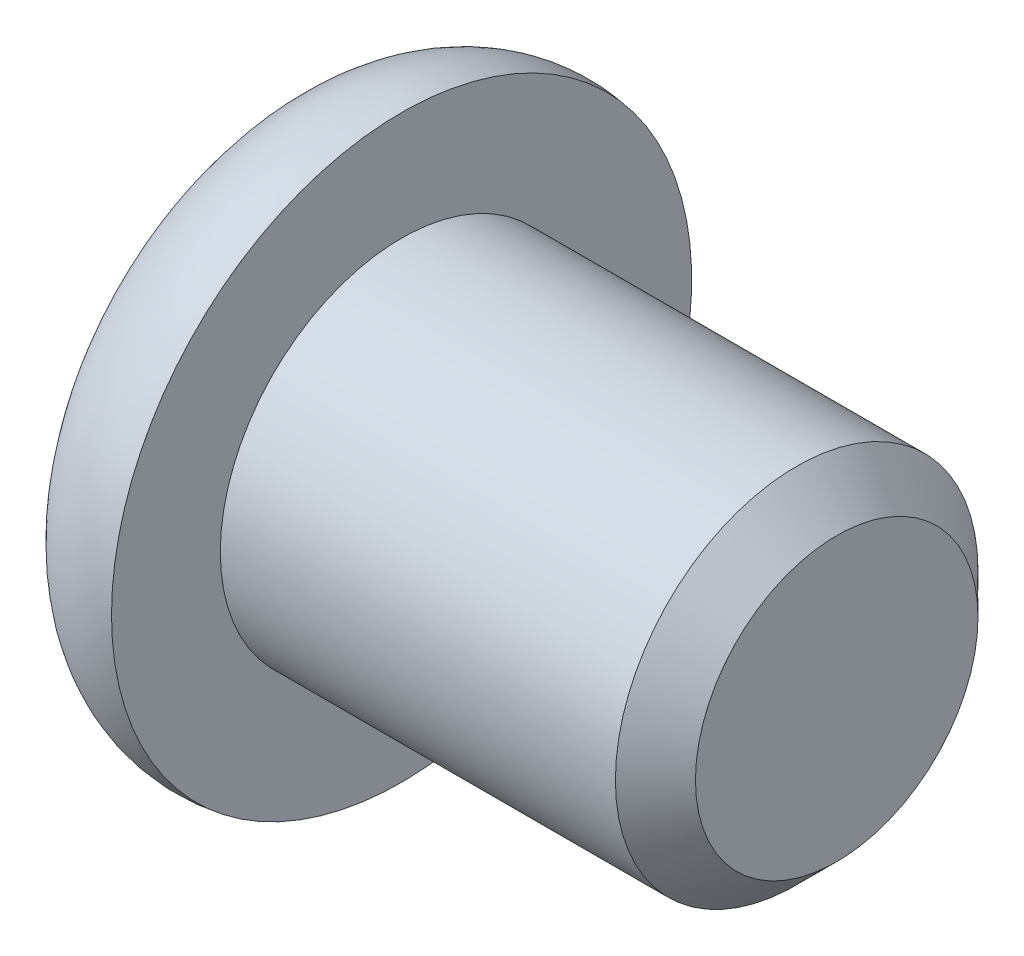
ISO-10303-21;
HEADER;
FILE_DESCRIPTION(('STEP AP214'),'2;1');
FILE_NAME('part.step','',(''),(''),'','','');
FILE_SCHEMA(('AUTOMOTIVE_DESIGN { 1 0 10303 214 1 1 1 1 }'));
ENDSEC;
DATA;
#1=APPLICATION_CONTEXT('core data for automotive mechanical design processes');
#2=APPLICATION_PROTOCOL_DEFINITION('international standard','automotive_design',2000,#1);
#3=PRODUCT_CONTEXT('',#1,'mechanical');
#4=PRODUCT('Part','Part','',(#3));
#5=PRODUCT_RELATED_PRODUCT_CATEGORY('part','',(#4));
#6=PRODUCT_DEFINITION_FORMATION('','',#4);
#7=PRODUCT_DEFINITION_CONTEXT('part definition',#1,'design');
#8=PRODUCT_DEFINITION('design','',#6,#7);
#9=PRODUCT_DEFINITION_SHAPE('','',#8);
#10=(LENGTH_UNIT() NAMED_UNIT(*) SI_UNIT(.MILLI.,.METRE.));
#11=(NAMED_UNIT(*) PLANE_ANGLE_UNIT() SI_UNIT($,.RADIAN.));
#12=(NAMED_UNIT(*) SI_UNIT($,.STERADIAN.) SOLID_ANGLE_UNIT());
#13=UNCERTAINTY_MEASURE_WITH_UNIT(LENGTH_MEASURE(1.E-05),#10,'distance_accuracy_value','');
#14=(GEOMETRIC_REPRESENTATION_CONTEXT(3) GLOBAL_UNCERTAINTY_ASSIGNED_CONTEXT((#13)) GLOBAL_UNIT_ASSIGNED_CONTEXT((#10,
#11,#12)) REPRESENTATION_CONTEXT('',''));
#15=CARTESIAN_POINT('',(0.,0.,0.));
#16=DIRECTION('',(0.,0.,1.));
#17=DIRECTION('',(1.,0.,0.));
#18=AXIS2_PLACEMENT_3D('',#15,#16,#17);
#19=CARTESIAN_POINT('',(0.4,-0.6,0.2));
#20=DIRECTION('',(-0.948683298050514,0.316227766016838,0.));
#21=DIRECTION('',(-0.316227766016838,-0.948683298050514,0.));
#22=AXIS2_PLACEMENT_3D('',#19,#20,#21);
#23=PLANE('',#22);
#24=DIRECTION('',(0.316227766016838,0.948683298050514,0.));
#25=VECTOR('',#24,1.);
#26=CARTESIAN_POINT('',(0.4,-0.6,0.2));
#27=LINE('',#26,#25);
#28=CARTESIAN_POINT('',(0.4,-0.6,0.2));
#29=VERTEX_POINT('',#28);
#30=CARTESIAN_POINT('',(0.533333333333333,-0.2,0.2));
#31=VERTEX_POINT('',#30);
#32=EDGE_CURVE('E212',#29,#31,#27,.T.);
#33=ORIENTED_EDGE('',*,*,#32,.T.);
#34=DIRECTION('',(0.,0.,-1.));
#35=VECTOR('',#34,1.);
#36=CARTESIAN_POINT('',(0.533333333333333,-0.2,0.2));
#37=LINE('',#36,#35);
#38=CARTESIAN_POINT('',(0.533333333333333,-0.2,-0.2));
#39=VERTEX_POINT('',#38);
#40=EDGE_CURVE('E163',#31,#39,#37,.T.);
#41=ORIENTED_EDGE('',*,*,#40,.T.);
#42=DIRECTION('',(0.316227766016838,0.948683298050514,0.));
#43=VECTOR('',#42,1.);
#44=CARTESIAN_POINT('',(0.4,-0.6,-0.2));
#45=LINE('',#44,#43);
#46=CARTESIAN_POINT('',(0.4,-0.6,-0.2));
#47=VERTEX_POINT('',#46);
#48=EDGE_CURVE('E198',#47,#39,#45,.T.);
#49=ORIENTED_EDGE('',*,*,#48,.F.);
#50=DIRECTION('',(0.,0.,-1.));
#51=VECTOR('',#50,1.);
#52=CARTESIAN_POINT('',(0.4,-0.6,0.2));
#53=LINE('',#52,#51);
#54=EDGE_CURVE('E231',#29,#47,#53,.T.);
#55=ORIENTED_EDGE('',*,*,#54,.F.);
#56=EDGE_LOOP('',(#33,#41,#49,#55));
#57=FACE_BOUND('',#56,.T.);
#58=ADVANCED_FACE('F37',(#57),#23,.T.);
#59=CARTESIAN_POINT('',(0.,0.,0.2));
#60=DIRECTION('',(0.,0.,1.));
#61=DIRECTION('',(1.,0.,0.));
#62=AXIS2_PLACEMENT_3D('',#59,#60,#61);
#63=PLANE('',#62);
#64=DIRECTION('',(-1.,0.,0.));
#65=VECTOR('',#64,1.);
#66=CARTESIAN_POINT('',(0.,-0.2,0.2));
#67=LINE('',#66,#65);
#68=CARTESIAN_POINT('',(-0.8,-0.2,0.2));
#69=VERTEX_POINT('',#68);
#70=EDGE_CURVE('E144',#31,#69,#67,.T.);
#71=ORIENTED_EDGE('',*,*,#70,.F.);
#72=ORIENTED_EDGE('',*,*,#32,.F.);
#73=DIRECTION('',(0.894427190999916,0.447213595499958,0.));
#74=VECTOR('',#73,1.);
#75=CARTESIAN_POINT('',(-0.8,-1.2,0.2));
#76=LINE('',#75,#74);
#77=CARTESIAN_POINT('',(-0.8,-1.2,0.2));
#78=VERTEX_POINT('',#77);
#79=EDGE_CURVE('E209',#78,#29,#76,.T.);
#80=ORIENTED_EDGE('',*,*,#79,.F.);
#81=DIRECTION('',(0.,-1.,0.));
#82=VECTOR('',#81,1.);
#83=CARTESIAN_POINT('',(-0.8,1.2,0.2));
#84=LINE('',#83,#82);
#85=EDGE_CURVE('E206',#69,#78,#84,.T.);
#86=ORIENTED_EDGE('',*,*,#85,.F.);
#87=EDGE_LOOP('',(#71,#72,#80,#86));
#88=FACE_BOUND('',#87,.T.);
#89=ADVANCED_FACE('F328',(#88),#63,.F.);
#90=CARTESIAN_POINT('',(0.,0.,-0.2));
#91=DIRECTION('',(0.,0.,1.));
#92=DIRECTION('',(1.,0.,0.));
#93=AXIS2_PLACEMENT_3D('',#90,#91,#92);
#94=PLANE('',#93);
#95=ORIENTED_EDGE('',*,*,#48,.T.);
#96=DIRECTION('',(-1.,0.,0.));
#97=VECTOR('',#96,1.);
#98=CARTESIAN_POINT('',(0.,-0.2,-0.2));
#99=LINE('',#98,#97);
#100=CARTESIAN_POINT('',(-0.8,-0.2,-0.2));
#101=VERTEX_POINT('',#100);
#102=EDGE_CURVE('E251',#39,#101,#99,.T.);
#103=ORIENTED_EDGE('',*,*,#102,.T.);
#104=DIRECTION('',(0.,-1.,0.));
#105=VECTOR('',#104,1.);
#106=CARTESIAN_POINT('',(-0.8,1.2,-0.2));
#107=LINE('',#106,#105);
#108=CARTESIAN_POINT('',(-0.8,-1.2,-0.2));
#109=VERTEX_POINT('',#108);
#110=EDGE_CURVE('E190',#101,#109,#107,.T.);
#111=ORIENTED_EDGE('',*,*,#110,.T.);
#112=DIRECTION('',(0.894427190999916,0.447213595499958,0.));
#113=VECTOR('',#112,1.);
#114=CARTESIAN_POINT('',(-0.8,-1.2,-0.2));
#115=LINE('',#114,#113);
#116=EDGE_CURVE('E194',#109,#47,#115,.T.);
#117=ORIENTED_EDGE('',*,*,#116,.T.);
#118=EDGE_LOOP('',(#95,#103,#111,#117));
#119=FACE_BOUND('',#118,.T.);
#120=ADVANCED_FACE('F337',(#119),#94,.T.);
#121=CARTESIAN_POINT('',(-0.8,0.,0.));
#122=DIRECTION('',(1.,0.,0.));
#123=DIRECTION('',(0.,0.,-1.));
#124=AXIS2_PLACEMENT_3D('',#121,#122,#123);
#125=PLANE('',#124);
#126=DIRECTION('',(0.,-1.,0.));
#127=VECTOR('',#126,1.);
#128=CARTESIAN_POINT('',(-0.8,0.2,-1.2));
#129=LINE('',#128,#127);
#130=CARTESIAN_POINT('',(-0.8,0.2,-1.2));
#131=VERTEX_POINT('',#130);
#132=CARTESIAN_POINT('',(-0.8,-0.2,-1.2));
#133=VERTEX_POINT('',#132);
#134=EDGE_CURVE('E266',#131,#133,#129,.T.);
#135=ORIENTED_EDGE('',*,*,#134,.F.);
#136=DIRECTION('',(0.,0.,1.));
#137=VECTOR('',#136,1.);
#138=CARTESIAN_POINT('',(-0.8,0.2,-1.2));
#139=LINE('',#138,#137);
#140=CARTESIAN_POINT('',(-0.8,0.2,-0.2));
#141=VERTEX_POINT('',#140);
#142=EDGE_CURVE('E260',#131,#141,#139,.T.);
#143=ORIENTED_EDGE('',*,*,#142,.T.);
#144=CARTESIAN_POINT('',(-0.8,1.2,-0.2));
#145=VERTEX_POINT('',#144);
#146=EDGE_CURVE('E191',#145,#141,#107,.T.);
#147=ORIENTED_EDGE('',*,*,#146,.F.);
#148=DIRECTION('',(0.,0.,-1.));
#149=VECTOR('',#148,1.);
#150=CARTESIAN_POINT('',(-0.8,1.2,0.2));
#151=LINE('',#150,#149);
#152=CARTESIAN_POINT('',(-0.8,1.2,0.2));
#153=VERTEX_POINT('',#152);
#154=EDGE_CURVE('E221',#153,#145,#151,.T.);
#155=ORIENTED_EDGE('',*,*,#154,.F.);
#156=CARTESIAN_POINT('',(-0.8,0.2,0.2));
#157=VERTEX_POINT('',#156);
#158=EDGE_CURVE('E207',#153,#157,#84,.T.);
#159=ORIENTED_EDGE('',*,*,#158,.T.);
#160=CARTESIAN_POINT('',(-0.8,0.2,1.2));
#161=VERTEX_POINT('',#160);
#162=EDGE_CURVE('E162',#157,#161,#139,.T.);
#163=ORIENTED_EDGE('',*,*,#162,.T.);
#164=DIRECTION('',(0.,-1.,0.));
#165=VECTOR('',#164,1.);
#166=CARTESIAN_POINT('',(-0.8,0.2,1.2));
#167=LINE('',#166,#165);
#168=CARTESIAN_POINT('',(-0.8,-0.2,1.2));
#169=VERTEX_POINT('',#168);
#170=EDGE_CURVE('E153',#161,#169,#167,.T.);
#171=ORIENTED_EDGE('',*,*,#170,.T.);
#172=DIRECTION('',(0.,0.,1.));
#173=VECTOR('',#172,1.);
#174=CARTESIAN_POINT('',(-0.8,-0.2,-1.2));
#175=LINE('',#174,#173);
#176=EDGE_CURVE('E139',#69,#169,#175,.T.);
#177=ORIENTED_EDGE('',*,*,#176,.F.);
#178=ORIENTED_EDGE('',*,*,#85,.T.);
#179=DIRECTION('',(0.,0.,-1.));
#180=VECTOR('',#179,1.);
#181=CARTESIAN_POINT('',(-0.8,-1.2,0.2));
#182=LINE('',#181,#180);
#183=EDGE_CURVE('E233',#78,#109,#182,.T.);
#184=ORIENTED_EDGE('',*,*,#183,.T.);
#185=ORIENTED_EDGE('',*,*,#110,.F.);
#186=EDGE_CURVE('E148',#133,#101,#175,.T.);
#187=ORIENTED_EDGE('',*,*,#186,.F.);
#188=EDGE_LOOP('',(#135,#143,#147,#155,#159,#163,#171,#177,#178,#184,#185,#187));
#189=FACE_BOUND('',#188,.T.);
#190=CARTESIAN_POINT('',(-0.8,0.,0.));
#191=DIRECTION('',(-1.,0.,0.));
#192=DIRECTION('',(0.,0.,1.));
#193=AXIS2_PLACEMENT_3D('',#190,#191,#192);
#194=CIRCLE('',#193,1.6);
#195=CARTESIAN_POINT('',(-0.8,0.,1.6));
#196=VERTEX_POINT('',#195);
#197=EDGE_CURVE('E248',#196,#196,#194,.T.);
#198=ORIENTED_EDGE('',*,*,#197,.T.);
#199=EDGE_LOOP('',(#198));
#200=FACE_BOUND('',#199,.T.);
#201=ADVANCED_FACE('F39',(#189,#200),#125,.F.);
#202=CARTESIAN_POINT('',(-0.130741759643298,0.,0.));
#203=DIRECTION('',(-1.,0.,0.));
#204=DIRECTION('',(0.,0.,1.));
#205=AXIS2_PLACEMENT_3D('',#202,#203,#204);
#206=TOROIDAL_SURFACE('',#205,1.2614835192866,0.749999999999958);
#207=ORIENTED_EDGE('',*,*,#197,.F.);
#208=EDGE_LOOP('',(#207));
#209=FACE_BOUND('',#208,.T.);
#210=CARTESIAN_POINT('',(0.,0.,0.));
#211=DIRECTION('',(-1.,0.,0.));
#212=DIRECTION('',(0.,0.,1.));
#213=AXIS2_PLACEMENT_3D('',#210,#211,#212);
#214=CIRCLE('',#213,2.);
#215=CARTESIAN_POINT('',(0.,0.,2.));
#216=VERTEX_POINT('',#215);
#217=EDGE_CURVE('E245',#216,#216,#214,.T.);
#218=ORIENTED_EDGE('',*,*,#217,.T.);
#219=EDGE_LOOP('',(#218));
#220=FACE_BOUND('',#219,.T.);
#221=ADVANCED_FACE('F558',(#209,#220),#206,.T.);
#222=CARTESIAN_POINT('',(0.,2.,0.));
#223=DIRECTION('',(-1.,0.,0.));
#224=DIRECTION('',(0.,0.,1.));
#225=AXIS2_PLACEMENT_3D('',#222,#223,#224);
#226=PLANE('',#225);
#227=ORIENTED_EDGE('',*,*,#217,.F.);
#228=EDGE_LOOP('',(#227));
#229=FACE_BOUND('',#228,.T.);
#230=CARTESIAN_POINT('',(0.,0.,0.));
#231=DIRECTION('',(-1.,0.,0.));
#232=DIRECTION('',(0.,0.,1.));
#233=AXIS2_PLACEMENT_3D('',#230,#231,#232);
#234=CIRCLE('',#233,1.25);
#235=CARTESIAN_POINT('',(0.,0.,1.25));
#236=VERTEX_POINT('',#235);
#237=EDGE_CURVE('E242',#236,#236,#234,.T.);
#238=ORIENTED_EDGE('',*,*,#237,.T.);
#239=EDGE_LOOP('',(#238));
#240=FACE_BOUND('',#239,.T.);
#241=ADVANCED_FACE('F611',(#229,#240),#226,.F.);
#242=CARTESIAN_POINT('',(3.,0.,0.));
#243=DIRECTION('',(-1.,0.,0.));
#244=DIRECTION('',(0.,0.,1.));
#245=AXIS2_PLACEMENT_3D('',#242,#243,#244);
#246=CYLINDRICAL_SURFACE('',#245,1.25);
#247=ORIENTED_EDGE('',*,*,#237,.F.);
#248=EDGE_LOOP('',(#247));
#249=FACE_BOUND('',#248,.T.);
#250=CARTESIAN_POINT('',(2.724,0.,0.));
#251=DIRECTION('',(-1.,0.,0.));
#252=DIRECTION('',(0.,0.,1.));
#253=AXIS2_PLACEMENT_3D('',#250,#251,#252);
#254=CIRCLE('',#253,1.25);
#255=CARTESIAN_POINT('',(2.724,0.,1.25));
#256=VERTEX_POINT('',#255);
#257=EDGE_CURVE('E239',#256,#256,#254,.T.);
#258=ORIENTED_EDGE('',*,*,#257,.T.);
#259=EDGE_LOOP('',(#258));
#260=FACE_BOUND('',#259,.T.);
#261=ADVANCED_FACE('F600',(#249,#260),#246,.T.);
#262=CARTESIAN_POINT('',(3.,0.,0.));
#263=DIRECTION('',(-1.,0.,0.));
#264=DIRECTION('',(0.,0.,1.));
#265=AXIS2_PLACEMENT_3D('',#262,#263,#264);
#266=CONICAL_SURFACE('',#265,0.974,0.785398163397448);
#267=ORIENTED_EDGE('',*,*,#257,.F.);
#268=EDGE_LOOP('',(#267));
#269=FACE_BOUND('',#268,.T.);
#270=CARTESIAN_POINT('',(3.,0.,0.));
#271=DIRECTION('',(-1.,0.,0.));
#272=DIRECTION('',(0.,0.,1.));
#273=AXIS2_PLACEMENT_3D('',#270,#271,#272);
#274=CIRCLE('',#273,0.974);
#275=CARTESIAN_POINT('',(3.,0.,0.974));
#276=VERTEX_POINT('',#275);
#277=EDGE_CURVE('E236',#276,#276,#274,.T.);
#278=ORIENTED_EDGE('',*,*,#277,.T.);
#279=EDGE_LOOP('',(#278));
#280=FACE_BOUND('',#279,.T.);
#281=ADVANCED_FACE('F590',(#269,#280),#266,.T.);
#282=CARTESIAN_POINT('',(3.,0.974,0.));
#283=DIRECTION('',(-1.,0.,0.));
#284=DIRECTION('',(0.,0.,1.));
#285=AXIS2_PLACEMENT_3D('',#282,#283,#284);
#286=PLANE('',#285);
#287=ORIENTED_EDGE('',*,*,#277,.F.);
#288=EDGE_LOOP('',(#287));
#289=FACE_BOUND('',#288,.T.);
#290=ADVANCED_FACE('F582',(#289),#286,.F.);
#291=CARTESIAN_POINT('',(-0.8,-1.2,0.2));
#292=DIRECTION('',(-0.447213595499958,0.894427190999916,0.));
#293=DIRECTION('',(-0.894427190999916,-0.447213595499958,0.));
#294=AXIS2_PLACEMENT_3D('',#291,#292,#293);
#295=PLANE('',#294);
#296=ORIENTED_EDGE('',*,*,#183,.F.);
#297=ORIENTED_EDGE('',*,*,#79,.T.);
#298=ORIENTED_EDGE('',*,*,#54,.T.);
#299=ORIENTED_EDGE('',*,*,#116,.F.);
#300=EDGE_LOOP('',(#296,#297,#298,#299));
#301=FACE_BOUND('',#300,.T.);
#302=ADVANCED_FACE('F334',(#301),#295,.T.);
#303=CARTESIAN_POINT('',(0.6,0.,0.2));
#304=DIRECTION('',(-0.948683298050514,-0.316227766016838,0.));
#305=DIRECTION('',(0.316227766016838,-0.948683298050514,0.));
#306=AXIS2_PLACEMENT_3D('',#303,#304,#305);
#307=PLANE('',#306);
#308=DIRECTION('',(0.,0.,-1.));
#309=VECTOR('',#308,1.);
#310=CARTESIAN_POINT('',(0.533333333333333,0.2,0.2));
#311=LINE('',#310,#309);
#312=CARTESIAN_POINT('',(0.533333333333333,0.2,0.2));
#313=VERTEX_POINT('',#312);
#314=CARTESIAN_POINT('',(0.533333333333333,0.2,-0.2));
#315=VERTEX_POINT('',#314);
#316=EDGE_CURVE('E172',#313,#315,#311,.T.);
#317=ORIENTED_EDGE('',*,*,#316,.F.);
#318=DIRECTION('',(-0.316227766016838,0.948683298050514,0.));
#319=VECTOR('',#318,1.);
#320=CARTESIAN_POINT('',(0.6,0.,0.2));
#321=LINE('',#320,#319);
#322=CARTESIAN_POINT('',(0.4,0.6,0.2));
#323=VERTEX_POINT('',#322);
#324=EDGE_CURVE('E215',#313,#323,#321,.T.);
#325=ORIENTED_EDGE('',*,*,#324,.T.);
#326=DIRECTION('',(0.,0.,-1.));
#327=VECTOR('',#326,1.);
#328=CARTESIAN_POINT('',(0.4,0.6,0.2));
#329=LINE('',#328,#327);
#330=CARTESIAN_POINT('',(0.4,0.6,-0.2));
#331=VERTEX_POINT('',#330);
#332=EDGE_CURVE('E224',#323,#331,#329,.T.);
#333=ORIENTED_EDGE('',*,*,#332,.T.);
#334=DIRECTION('',(-0.316227766016838,0.948683298050514,0.));
#335=VECTOR('',#334,1.);
#336=CARTESIAN_POINT('',(0.6,0.,-0.2));
#337=LINE('',#336,#335);
#338=EDGE_CURVE('E200',#315,#331,#337,.T.);
#339=ORIENTED_EDGE('',*,*,#338,.F.);
#340=EDGE_LOOP('',(#317,#325,#333,#339));
#341=FACE_BOUND('',#340,.T.);
#342=ADVANCED_FACE('F365',(#341),#307,.T.);
#343=CARTESIAN_POINT('',(0.4,0.6,0.2));
#344=DIRECTION('',(-0.447213595499958,-0.894427190999916,0.));
#345=DIRECTION('',(0.894427190999916,-0.447213595499958,0.));
#346=AXIS2_PLACEMENT_3D('',#343,#344,#345);
#347=PLANE('',#346);
#348=ORIENTED_EDGE('',*,*,#332,.F.);
#349=DIRECTION('',(-0.894427190999916,0.447213595499958,0.));
#350=VECTOR('',#349,1.);
#351=CARTESIAN_POINT('',(0.4,0.6,0.2));
#352=LINE('',#351,#350);
#353=EDGE_CURVE('E219',#323,#153,#352,.T.);
#354=ORIENTED_EDGE('',*,*,#353,.T.);
#355=ORIENTED_EDGE('',*,*,#154,.T.);
#356=DIRECTION('',(-0.894427190999916,0.447213595499958,0.));
#357=VECTOR('',#356,1.);
#358=CARTESIAN_POINT('',(0.4,0.6,-0.2));
#359=LINE('',#358,#357);
#360=EDGE_CURVE('E204',#331,#145,#359,.T.);
#361=ORIENTED_EDGE('',*,*,#360,.F.);
#362=EDGE_LOOP('',(#348,#354,#355,#361));
#363=FACE_BOUND('',#362,.T.);
#364=ADVANCED_FACE('F273',(#363),#347,.T.);
#365=ORIENTED_EDGE('',*,*,#324,.F.);
#366=DIRECTION('',(-1.,0.,0.));
#367=VECTOR('',#366,1.);
#368=CARTESIAN_POINT('',(0.,0.2,0.2));
#369=LINE('',#368,#367);
#370=EDGE_CURVE('E175',#313,#157,#369,.T.);
#371=ORIENTED_EDGE('',*,*,#370,.T.);
#372=ORIENTED_EDGE('',*,*,#158,.F.);
#373=ORIENTED_EDGE('',*,*,#353,.F.);
#374=EDGE_LOOP('',(#365,#371,#372,#373));
#375=FACE_BOUND('',#374,.T.);
#376=ADVANCED_FACE('F277',(#375),#63,.F.);
#377=DIRECTION('',(-1.,0.,0.));
#378=VECTOR('',#377,1.);
#379=CARTESIAN_POINT('',(0.,0.2,-0.2));
#380=LINE('',#379,#378);
#381=EDGE_CURVE('E45',#315,#141,#380,.T.);
#382=ORIENTED_EDGE('',*,*,#381,.F.);
#383=ORIENTED_EDGE('',*,*,#338,.T.);
#384=ORIENTED_EDGE('',*,*,#360,.T.);
#385=ORIENTED_EDGE('',*,*,#146,.T.);
#386=EDGE_LOOP('',(#382,#383,#384,#385));
#387=FACE_BOUND('',#386,.T.);
#388=ADVANCED_FACE('F269',(#387),#94,.T.);
#389=CARTESIAN_POINT('',(0.,-0.2,0.));
#390=DIRECTION('',(0.,1.,0.));
#391=DIRECTION('',(0.,0.,1.));
#392=AXIS2_PLACEMENT_3D('',#389,#390,#391);
#393=PLANE('',#392);
#394=DIRECTION('',(-0.316227766016838,0.,-0.948683298050514));
#395=VECTOR('',#394,1.);
#396=CARTESIAN_POINT('',(0.6,-0.2,0.));
#397=LINE('',#396,#395);
#398=CARTESIAN_POINT('',(0.4,-0.2,-0.6));
#399=VERTEX_POINT('',#398);
#400=EDGE_CURVE('E343',#39,#399,#397,.T.);
#401=ORIENTED_EDGE('',*,*,#400,.T.);
#402=DIRECTION('',(-0.894427190999916,0.,-0.447213595499958));
#403=VECTOR('',#402,1.);
#404=CARTESIAN_POINT('',(0.4,-0.2,-0.6));
#405=LINE('',#404,#403);
#406=EDGE_CURVE('E410',#399,#133,#405,.T.);
#407=ORIENTED_EDGE('',*,*,#406,.T.);
#408=ORIENTED_EDGE('',*,*,#186,.T.);
#409=ORIENTED_EDGE('',*,*,#102,.F.);
#410=EDGE_LOOP('',(#401,#407,#408,#409));
#411=FACE_BOUND('',#410,.T.);
#412=ADVANCED_FACE('F341',(#411),#393,.T.);
#413=CARTESIAN_POINT('',(0.,0.2,0.));
#414=DIRECTION('',(0.,1.,0.));
#415=DIRECTION('',(0.,0.,1.));
#416=AXIS2_PLACEMENT_3D('',#413,#414,#415);
#417=PLANE('',#416);
#418=ORIENTED_EDGE('',*,*,#381,.T.);
#419=ORIENTED_EDGE('',*,*,#142,.F.);
#420=DIRECTION('',(-0.894427190999916,0.,-0.447213595499958));
#421=VECTOR('',#420,1.);
#422=CARTESIAN_POINT('',(0.4,0.2,-0.6));
#423=LINE('',#422,#421);
#424=CARTESIAN_POINT('',(0.4,0.2,-0.6));
#425=VERTEX_POINT('',#424);
#426=EDGE_CURVE('E415',#425,#131,#423,.T.);
#427=ORIENTED_EDGE('',*,*,#426,.F.);
#428=DIRECTION('',(-0.316227766016838,0.,-0.948683298050514));
#429=VECTOR('',#428,1.);
#430=CARTESIAN_POINT('',(0.6,0.2,0.));
#431=LINE('',#430,#429);
#432=EDGE_CURVE('E59',#315,#425,#431,.T.);
#433=ORIENTED_EDGE('',*,*,#432,.F.);
#434=EDGE_LOOP('',(#418,#419,#427,#433));
#435=FACE_BOUND('',#434,.T.);
#436=ADVANCED_FACE('F259',(#435),#417,.F.);
#437=CARTESIAN_POINT('',(0.6,0.2,0.));
#438=DIRECTION('',(-0.948683298050514,0.,0.316227766016838));
#439=DIRECTION('',(0.316227766016838,0.,0.948683298050514));
#440=AXIS2_PLACEMENT_3D('',#437,#438,#439);
#441=PLANE('',#440);
#442=ORIENTED_EDGE('',*,*,#432,.T.);
#443=DIRECTION('',(0.,-1.,0.));
#444=VECTOR('',#443,1.);
#445=CARTESIAN_POINT('',(0.4,0.2,-0.6));
#446=LINE('',#445,#444);
#447=EDGE_CURVE('E407',#425,#399,#446,.T.);
#448=ORIENTED_EDGE('',*,*,#447,.T.);
#449=ORIENTED_EDGE('',*,*,#400,.F.);
#450=DIRECTION('',(0.,-1.,0.));
#451=VECTOR('',#450,1.);
#452=CARTESIAN_POINT('',(0.533333333333333,0.,-0.2));
#453=LINE('',#452,#451);
#454=EDGE_CURVE('E254',#315,#39,#453,.T.);
#455=ORIENTED_EDGE('',*,*,#454,.F.);
#456=EDGE_LOOP('',(#442,#448,#449,#455));
#457=FACE_BOUND('',#456,.T.);
#458=ADVANCED_FACE('F402',(#457),#441,.T.);
#459=CARTESIAN_POINT('',(0.4,0.2,-0.6));
#460=DIRECTION('',(-0.447213595499958,0.,0.894427190999916));
#461=DIRECTION('',(0.894427190999916,0.,0.447213595499958));
#462=AXIS2_PLACEMENT_3D('',#459,#460,#461);
#463=PLANE('',#462);
#464=ORIENTED_EDGE('',*,*,#447,.F.);
#465=ORIENTED_EDGE('',*,*,#426,.T.);
#466=ORIENTED_EDGE('',*,*,#134,.T.);
#467=ORIENTED_EDGE('',*,*,#406,.F.);
#468=EDGE_LOOP('',(#464,#465,#466,#467));
#469=FACE_BOUND('',#468,.T.);
#470=ADVANCED_FACE('F396',(#469),#463,.T.);
#471=CARTESIAN_POINT('',(0.6,0.,-0.2));
#472=VERTEX_POINT('',#471);
#473=EDGE_CURVE('E201',#472,#315,#337,.T.);
#474=ORIENTED_EDGE('',*,*,#473,.T.);
#475=ORIENTED_EDGE('',*,*,#454,.T.);
#476=EDGE_CURVE('E197',#39,#472,#45,.T.);
#477=ORIENTED_EDGE('',*,*,#476,.T.);
#478=EDGE_LOOP('',(#474,#475,#477));
#479=FACE_BOUND('',#478,.T.);
#480=ADVANCED_FACE('F377',(#479),#94,.T.);
#481=DIRECTION('',(0.,0.,-1.));
#482=VECTOR('',#481,1.);
#483=CARTESIAN_POINT('',(0.6,0.,0.2));
#484=LINE('',#483,#482);
#485=CARTESIAN_POINT('',(0.6,0.,0.));
#486=VERTEX_POINT('',#485);
#487=EDGE_CURVE('E227',#486,#472,#484,.T.);
#488=ORIENTED_EDGE('',*,*,#487,.F.);
#489=DIRECTION('',(-0.229415733870562,0.688247201611685,-0.688247201611685));
#490=VECTOR('',#489,1.);
#491=CARTESIAN_POINT('',(0.631578947368421,-0.0947368421052632,0.0947368421052632));
#492=LINE('',#491,#490);
#493=EDGE_CURVE('E178',#486,#315,#492,.T.);
#494=ORIENTED_EDGE('',*,*,#493,.T.);
#495=ORIENTED_EDGE('',*,*,#473,.F.);
#496=EDGE_LOOP('',(#488,#494,#495));
#497=FACE_BOUND('',#496,.T.);
#498=ADVANCED_FACE('F353',(#497),#307,.T.);
#499=ORIENTED_EDGE('',*,*,#476,.F.);
#500=DIRECTION('',(0.229415733870562,0.688247201611685,0.688247201611685));
#501=VECTOR('',#500,1.);
#502=CARTESIAN_POINT('',(0.526315789473684,-0.221052631578947,-0.221052631578947));
#503=LINE('',#502,#501);
#504=EDGE_CURVE('E181',#39,#486,#503,.T.);
#505=ORIENTED_EDGE('',*,*,#504,.T.);
#506=ORIENTED_EDGE('',*,*,#487,.T.);
#507=EDGE_LOOP('',(#499,#505,#506));
#508=FACE_BOUND('',#507,.T.);
#509=ADVANCED_FACE('F349',(#508),#23,.T.);
#510=ORIENTED_EDGE('',*,*,#70,.T.);
#511=ORIENTED_EDGE('',*,*,#176,.T.);
#512=DIRECTION('',(0.894427190999916,0.,-0.447213595499958));
#513=VECTOR('',#512,1.);
#514=CARTESIAN_POINT('',(-0.8,-0.2,1.2));
#515=LINE('',#514,#513);
#516=CARTESIAN_POINT('',(0.4,-0.2,0.6));
#517=VERTEX_POINT('',#516);
#518=EDGE_CURVE('E142',#169,#517,#515,.T.);
#519=ORIENTED_EDGE('',*,*,#518,.T.);
#520=DIRECTION('',(0.316227766016838,0.,-0.948683298050514));
#521=VECTOR('',#520,1.);
#522=CARTESIAN_POINT('',(0.4,-0.2,0.6));
#523=LINE('',#522,#521);
#524=EDGE_CURVE('E52',#517,#31,#523,.T.);
#525=ORIENTED_EDGE('',*,*,#524,.T.);
#526=EDGE_LOOP('',(#510,#511,#519,#525));
#527=FACE_BOUND('',#526,.T.);
#528=ADVANCED_FACE('F141',(#527),#393,.T.);
#529=DIRECTION('',(0.316227766016838,0.,-0.948683298050514));
#530=VECTOR('',#529,1.);
#531=CARTESIAN_POINT('',(0.4,0.2,0.6));
#532=LINE('',#531,#530);
#533=CARTESIAN_POINT('',(0.4,0.2,0.6));
#534=VERTEX_POINT('',#533);
#535=EDGE_CURVE('E285',#534,#313,#532,.T.);
#536=ORIENTED_EDGE('',*,*,#535,.F.);
#537=DIRECTION('',(0.894427190999916,0.,-0.447213595499958));
#538=VECTOR('',#537,1.);
#539=CARTESIAN_POINT('',(-0.8,0.2,1.2));
#540=LINE('',#539,#538);
#541=EDGE_CURVE('E267',#161,#534,#540,.T.);
#542=ORIENTED_EDGE('',*,*,#541,.F.);
#543=ORIENTED_EDGE('',*,*,#162,.F.);
#544=ORIENTED_EDGE('',*,*,#370,.F.);
#545=EDGE_LOOP('',(#536,#542,#543,#544));
#546=FACE_BOUND('',#545,.T.);
#547=ADVANCED_FACE('F283',(#546),#417,.F.);
#548=CARTESIAN_POINT('',(0.4,0.2,0.6));
#549=DIRECTION('',(-0.948683298050514,0.,-0.316227766016838));
#550=DIRECTION('',(-0.316227766016838,0.,0.948683298050514));
#551=AXIS2_PLACEMENT_3D('',#548,#549,#550);
#552=PLANE('',#551);
#553=DIRECTION('',(0.,-1.,0.));
#554=VECTOR('',#553,1.);
#555=CARTESIAN_POINT('',(0.533333333333333,0.,0.2));
#556=LINE('',#555,#554);
#557=EDGE_CURVE('E11',#313,#31,#556,.T.);
#558=ORIENTED_EDGE('',*,*,#557,.T.);
#559=ORIENTED_EDGE('',*,*,#524,.F.);
#560=DIRECTION('',(0.,-1.,0.));
#561=VECTOR('',#560,1.);
#562=CARTESIAN_POINT('',(0.4,0.2,0.6));
#563=LINE('',#562,#561);
#564=EDGE_CURVE('E156',#534,#517,#563,.T.);
#565=ORIENTED_EDGE('',*,*,#564,.F.);
#566=ORIENTED_EDGE('',*,*,#535,.T.);
#567=EDGE_LOOP('',(#558,#559,#565,#566));
#568=FACE_BOUND('',#567,.T.);
#569=ADVANCED_FACE('F308',(#568),#552,.T.);
#570=CARTESIAN_POINT('',(-0.8,0.2,1.2));
#571=DIRECTION('',(-0.447213595499958,0.,-0.894427190999916));
#572=DIRECTION('',(-0.894427190999916,0.,0.447213595499958));
#573=AXIS2_PLACEMENT_3D('',#570,#571,#572);
#574=PLANE('',#573);
#575=ORIENTED_EDGE('',*,*,#170,.F.);
#576=ORIENTED_EDGE('',*,*,#541,.T.);
#577=ORIENTED_EDGE('',*,*,#564,.T.);
#578=ORIENTED_EDGE('',*,*,#518,.F.);
#579=EDGE_LOOP('',(#575,#576,#577,#578));
#580=FACE_BOUND('',#579,.T.);
#581=ADVANCED_FACE('F152',(#580),#574,.T.);
#582=ORIENTED_EDGE('',*,*,#557,.F.);
#583=CARTESIAN_POINT('',(0.6,0.,0.2));
#584=VERTEX_POINT('',#583);
#585=EDGE_CURVE('E216',#584,#313,#321,.T.);
#586=ORIENTED_EDGE('',*,*,#585,.F.);
#587=EDGE_CURVE('E211',#31,#584,#27,.T.);
#588=ORIENTED_EDGE('',*,*,#587,.F.);
#589=EDGE_LOOP('',(#582,#586,#588));
#590=FACE_BOUND('',#589,.T.);
#591=ADVANCED_FACE('F305',(#590),#63,.F.);
#592=ORIENTED_EDGE('',*,*,#585,.T.);
#593=DIRECTION('',(0.229415733870562,-0.688247201611685,-0.688247201611685));
#594=VECTOR('',#593,1.);
#595=CARTESIAN_POINT('',(0.568421052631579,0.0947368421052631,0.0947368421052632));
#596=LINE('',#595,#594);
#597=EDGE_CURVE('E184',#313,#486,#596,.T.);
#598=ORIENTED_EDGE('',*,*,#597,.T.);
#599=EDGE_CURVE('E228',#584,#486,#484,.T.);
#600=ORIENTED_EDGE('',*,*,#599,.F.);
#601=EDGE_LOOP('',(#592,#598,#600));
#602=FACE_BOUND('',#601,.T.);
#603=ADVANCED_FACE('F302',(#602),#307,.T.);
#604=ORIENTED_EDGE('',*,*,#599,.T.);
#605=DIRECTION('',(-0.229415733870562,-0.688247201611685,0.688247201611685));
#606=VECTOR('',#605,1.);
#607=CARTESIAN_POINT('',(0.463157894736842,-0.410526315789474,0.410526315789474));
#608=LINE('',#607,#606);
#609=EDGE_CURVE('E187',#486,#31,#608,.T.);
#610=ORIENTED_EDGE('',*,*,#609,.T.);
#611=ORIENTED_EDGE('',*,*,#587,.T.);
#612=EDGE_LOOP('',(#604,#610,#611));
#613=FACE_BOUND('',#612,.T.);
#614=ADVANCED_FACE('F355',(#613),#23,.T.);
#615=ORIENTED_EDGE('',*,*,#316,.T.);
#616=CARTESIAN_POINT('',(0.6,0.2,0.));
#617=VERTEX_POINT('',#616);
#618=EDGE_CURVE('E298',#617,#315,#431,.T.);
#619=ORIENTED_EDGE('',*,*,#618,.F.);
#620=EDGE_CURVE('E290',#313,#617,#532,.T.);
#621=ORIENTED_EDGE('',*,*,#620,.F.);
#622=EDGE_LOOP('',(#615,#619,#621));
#623=FACE_BOUND('',#622,.T.);
#624=ADVANCED_FACE('F296',(#623),#417,.F.);
#625=DIRECTION('',(0.,-1.,0.));
#626=VECTOR('',#625,1.);
#627=CARTESIAN_POINT('',(0.6,0.2,0.));
#628=LINE('',#627,#626);
#629=EDGE_CURVE('E167',#617,#486,#628,.T.);
#630=ORIENTED_EDGE('',*,*,#629,.F.);
#631=ORIENTED_EDGE('',*,*,#618,.T.);
#632=ORIENTED_EDGE('',*,*,#493,.F.);
#633=EDGE_LOOP('',(#630,#631,#632));
#634=FACE_BOUND('',#633,.T.);
#635=ADVANCED_FACE('F362',(#634),#441,.T.);
#636=ORIENTED_EDGE('',*,*,#620,.T.);
#637=ORIENTED_EDGE('',*,*,#629,.T.);
#638=ORIENTED_EDGE('',*,*,#597,.F.);
#639=EDGE_LOOP('',(#636,#637,#638));
#640=FACE_BOUND('',#639,.T.);
#641=ADVANCED_FACE('F289',(#640),#552,.T.);
#642=CARTESIAN_POINT('',(0.6,-0.2,0.));
#643=VERTEX_POINT('',#642);
#644=EDGE_CURVE('E324',#486,#643,#628,.T.);
#645=ORIENTED_EDGE('',*,*,#644,.T.);
#646=EDGE_CURVE('E157',#31,#643,#523,.T.);
#647=ORIENTED_EDGE('',*,*,#646,.F.);
#648=ORIENTED_EDGE('',*,*,#609,.F.);
#649=EDGE_LOOP('',(#645,#647,#648));
#650=FACE_BOUND('',#649,.T.);
#651=ADVANCED_FACE('F322',(#650),#552,.T.);
#652=EDGE_CURVE('E315',#643,#39,#397,.T.);
#653=ORIENTED_EDGE('',*,*,#652,.F.);
#654=ORIENTED_EDGE('',*,*,#644,.F.);
#655=ORIENTED_EDGE('',*,*,#504,.F.);
#656=EDGE_LOOP('',(#653,#654,#655));
#657=FACE_BOUND('',#656,.T.);
#658=ADVANCED_FACE('F346',(#657),#441,.T.);
#659=ORIENTED_EDGE('',*,*,#646,.T.);
#660=ORIENTED_EDGE('',*,*,#652,.T.);
#661=ORIENTED_EDGE('',*,*,#40,.F.);
#662=EDGE_LOOP('',(#659,#660,#661));
#663=FACE_BOUND('',#662,.T.);
#664=ADVANCED_FACE('F313',(#663),#393,.T.);
#665=CLOSED_SHELL('',(#58,#89,#120,#201,#221,#241,#261,#281,#290,#302,#342,#364,#376,#388,#412,
#436,#458,#470,#480,#498,#509,#528,#547,#569,#581,#591,#603,#614,#624,#635,#641,#651,#658,#664));
#666=MANIFOLD_SOLID_BREP('B2',#665);
#667=ADVANCED_BREP_SHAPE_REPRESENTATION('',(#18,#666),#14);
#668=SHAPE_DEFINITION_REPRESENTATION(#9,#667);
ENDSEC;
END-ISO-10303-21;
